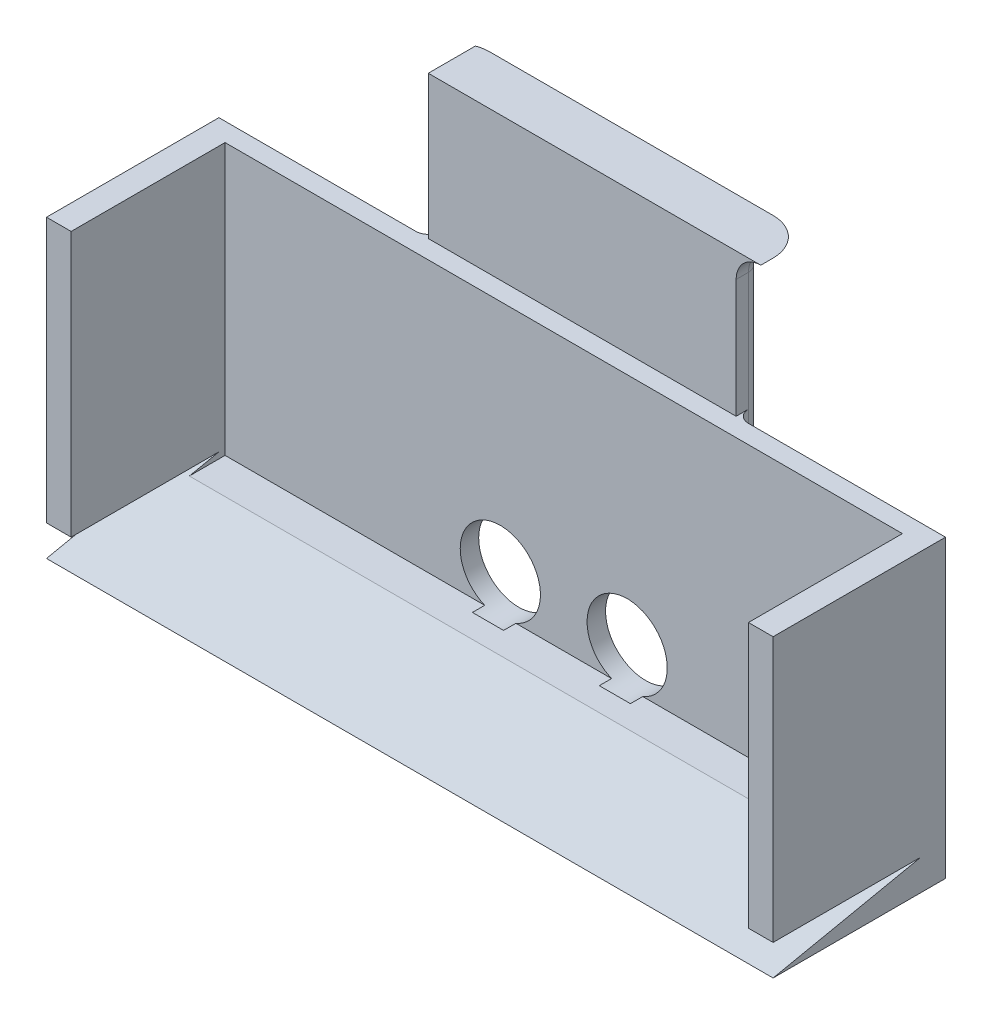
ISO-10303-21;
HEADER;
FILE_DESCRIPTION(('STEP AP214'),'2;1');
FILE_NAME('part.step','',(''),(''),'','','');
FILE_SCHEMA(('AUTOMOTIVE_DESIGN { 1 0 10303 214 1 1 1 1 }'));
ENDSEC;
DATA;
#1=APPLICATION_CONTEXT('core data for automotive mechanical design processes');
#2=APPLICATION_PROTOCOL_DEFINITION('international standard','automotive_design',2000,#1);
#3=PRODUCT_CONTEXT('',#1,'mechanical');
#4=PRODUCT('Part','Part','',(#3));
#5=PRODUCT_RELATED_PRODUCT_CATEGORY('part','',(#4));
#6=PRODUCT_DEFINITION_FORMATION('','',#4);
#7=PRODUCT_DEFINITION_CONTEXT('part definition',#1,'design');
#8=PRODUCT_DEFINITION('design','',#6,#7);
#9=PRODUCT_DEFINITION_SHAPE('','',#8);
#10=(LENGTH_UNIT() NAMED_UNIT(*) SI_UNIT(.MILLI.,.METRE.));
#11=(NAMED_UNIT(*) PLANE_ANGLE_UNIT() SI_UNIT($,.RADIAN.));
#12=(NAMED_UNIT(*) SI_UNIT($,.STERADIAN.) SOLID_ANGLE_UNIT());
#13=UNCERTAINTY_MEASURE_WITH_UNIT(LENGTH_MEASURE(1.E-05),#10,'distance_accuracy_value','');
#14=(GEOMETRIC_REPRESENTATION_CONTEXT(3) GLOBAL_UNCERTAINTY_ASSIGNED_CONTEXT((#13)) GLOBAL_UNIT_ASSIGNED_CONTEXT((#10,
#11,#12)) REPRESENTATION_CONTEXT('',''));
#15=CARTESIAN_POINT('',(0.,0.,0.));
#16=DIRECTION('',(0.,0.,1.));
#17=DIRECTION('',(1.,0.,0.));
#18=AXIS2_PLACEMENT_3D('',#15,#16,#17);
#19=CARTESIAN_POINT('',(31.75,39.6875,-24.765));
#20=DIRECTION('',(1.,0.,0.));
#21=DIRECTION('',(0.,0.,-1.));
#22=AXIS2_PLACEMENT_3D('',#19,#20,#21);
#23=PLANE('',#22);
#24=DIRECTION('',(0.,1.,0.));
#25=VECTOR('',#24,1.);
#26=CARTESIAN_POINT('',(31.75,90.4875,-22.225));
#27=LINE('',#26,#25);
#28=CARTESIAN_POINT('',(31.75,60.96,-22.225));
#29=VERTEX_POINT('',#28);
#30=CARTESIAN_POINT('',(31.75,85.4075,-22.225));
#31=VERTEX_POINT('',#30);
#32=EDGE_CURVE('E233',#29,#31,#27,.T.);
#33=ORIENTED_EDGE('',*,*,#32,.T.);
#34=DIRECTION('',(0.,0.,-1.));
#35=VECTOR('',#34,1.);
#36=CARTESIAN_POINT('',(31.75,85.4075,-24.765));
#37=LINE('',#36,#35);
#38=CARTESIAN_POINT('',(31.75,85.4075,-19.685));
#39=VERTEX_POINT('',#38);
#40=EDGE_CURVE('E54',#31,#39,#37,.F.);
#41=ORIENTED_EDGE('',*,*,#40,.T.);
#42=DIRECTION('',(0.,1.,0.));
#43=VECTOR('',#42,1.);
#44=CARTESIAN_POINT('',(31.75,39.6875,-19.685));
#45=LINE('',#44,#43);
#46=CARTESIAN_POINT('',(31.75,60.96,-19.685));
#47=VERTEX_POINT('',#46);
#48=EDGE_CURVE('E435',#47,#39,#45,.T.);
#49=ORIENTED_EDGE('',*,*,#48,.F.);
#50=DIRECTION('',(0.,0.,-1.));
#51=VECTOR('',#50,1.);
#52=CARTESIAN_POINT('',(31.75,60.96,-24.765));
#53=LINE('',#52,#51);
#54=EDGE_CURVE('E360',#47,#29,#53,.T.);
#55=ORIENTED_EDGE('',*,*,#54,.T.);
#56=EDGE_LOOP('',(#33,#41,#49,#55));
#57=FACE_BOUND('',#56,.T.);
#58=ADVANCED_FACE('F36',(#57),#23,.T.);
#59=CARTESIAN_POINT('',(0.,5.08,0.));
#60=DIRECTION('',(0.,-1.,0.));
#61=DIRECTION('',(0.,0.,-1.));
#62=AXIS2_PLACEMENT_3D('',#59,#60,#61);
#63=PLANE('',#62);
#64=DIRECTION('',(0.,0.,-1.));
#65=VECTOR('',#64,1.);
#66=CARTESIAN_POINT('',(-16.2939452376118,5.08,-13.335));
#67=LINE('',#66,#65);
#68=CARTESIAN_POINT('',(-16.2939452376118,5.08,-15.875));
#69=VERTEX_POINT('',#68);
#70=CARTESIAN_POINT('',(-16.2939452376118,5.08,-13.335));
#71=VERTEX_POINT('',#70);
#72=EDGE_CURVE('E428',#69,#71,#67,.F.);
#73=ORIENTED_EDGE('',*,*,#72,.F.);
#74=DIRECTION('',(1.,0.,0.));
#75=VECTOR('',#74,1.);
#76=CARTESIAN_POINT('',(-69.85,5.08,-15.875));
#77=LINE('',#76,#75);
#78=CARTESIAN_POINT('',(-69.85,5.08,-15.875));
#79=VERTEX_POINT('',#78);
#80=EDGE_CURVE('E522',#79,#69,#77,.T.);
#81=ORIENTED_EDGE('',*,*,#80,.F.);
#82=DIRECTION('',(0.,0.,-1.));
#83=VECTOR('',#82,1.);
#84=CARTESIAN_POINT('',(-69.85,5.08,15.875));
#85=LINE('',#84,#83);
#86=CARTESIAN_POINT('',(-69.85,5.08,-8.50899999999995));
#87=VERTEX_POINT('',#86);
#88=EDGE_CURVE('E519',#87,#79,#85,.T.);
#89=ORIENTED_EDGE('',*,*,#88,.F.);
#90=DIRECTION('',(1.,0.,0.));
#91=VECTOR('',#90,1.);
#92=CARTESIAN_POINT('',(0.,5.08,-8.50899999999999));
#93=LINE('',#92,#91);
#94=CARTESIAN_POINT('',(69.85,5.08,-8.50899999999999));
#95=VERTEX_POINT('',#94);
#96=EDGE_CURVE('E456',#87,#95,#93,.T.);
#97=ORIENTED_EDGE('',*,*,#96,.T.);
#98=DIRECTION('',(0.,0.,-1.));
#99=VECTOR('',#98,1.);
#100=CARTESIAN_POINT('',(69.85,5.08,15.875));
#101=LINE('',#100,#99);
#102=CARTESIAN_POINT('',(69.85,5.08,-15.875));
#103=VERTEX_POINT('',#102);
#104=EDGE_CURVE('E525',#95,#103,#101,.T.);
#105=ORIENTED_EDGE('',*,*,#104,.T.);
#106=CARTESIAN_POINT('',(16.2939452376118,5.08,-15.875));
#107=VERTEX_POINT('',#106);
#108=EDGE_CURVE('E521',#107,#103,#77,.T.);
#109=ORIENTED_EDGE('',*,*,#108,.F.);
#110=DIRECTION('',(0.,0.,-1.));
#111=VECTOR('',#110,1.);
#112=CARTESIAN_POINT('',(16.2939452376118,5.08,-13.335));
#113=LINE('',#112,#111);
#114=CARTESIAN_POINT('',(16.2939452376118,5.08,-13.335));
#115=VERTEX_POINT('',#114);
#116=EDGE_CURVE('E417',#115,#107,#113,.T.);
#117=ORIENTED_EDGE('',*,*,#116,.F.);
#118=DIRECTION('',(-1.,0.,0.));
#119=VECTOR('',#118,1.);
#120=CARTESIAN_POINT('',(0.,5.08,-13.335));
#121=LINE('',#120,#119);
#122=CARTESIAN_POINT('',(9.8680547623882,5.08,-13.335));
#123=VERTEX_POINT('',#122);
#124=EDGE_CURVE('E539',#115,#123,#121,.T.);
#125=ORIENTED_EDGE('',*,*,#124,.T.);
#126=DIRECTION('',(0.,0.,-1.));
#127=VECTOR('',#126,1.);
#128=CARTESIAN_POINT('',(9.8680547623882,5.08,-13.335));
#129=LINE('',#128,#127);
#130=CARTESIAN_POINT('',(9.8680547623882,5.08,-15.875));
#131=VERTEX_POINT('',#130);
#132=EDGE_CURVE('E421',#131,#123,#129,.F.);
#133=ORIENTED_EDGE('',*,*,#132,.F.);
#134=CARTESIAN_POINT('',(-9.86805476238824,5.08,-15.875));
#135=VERTEX_POINT('',#134);
#136=EDGE_CURVE('E526',#135,#131,#77,.T.);
#137=ORIENTED_EDGE('',*,*,#136,.F.);
#138=DIRECTION('',(0.,0.,-1.));
#139=VECTOR('',#138,1.);
#140=CARTESIAN_POINT('',(-9.86805476238824,5.08,-13.335));
#141=LINE('',#140,#139);
#142=CARTESIAN_POINT('',(-9.86805476238824,5.08,-13.335));
#143=VERTEX_POINT('',#142);
#144=EDGE_CURVE('E426',#143,#135,#141,.T.);
#145=ORIENTED_EDGE('',*,*,#144,.F.);
#146=DIRECTION('',(-1.,0.,0.));
#147=VECTOR('',#146,1.);
#148=CARTESIAN_POINT('',(0.,5.08,-13.335));
#149=LINE('',#148,#147);
#150=EDGE_CURVE('E542',#143,#71,#149,.T.);
#151=ORIENTED_EDGE('',*,*,#150,.T.);
#152=EDGE_LOOP('',(#73,#81,#89,#97,#105,#109,#117,#125,#133,#137,#145,#151));
#153=FACE_BOUND('',#152,.T.);
#154=ADVANCED_FACE('F284',(#153),#63,.F.);
#155=CARTESIAN_POINT('',(0.,0.,-19.685));
#156=DIRECTION('',(0.,0.,-1.));
#157=DIRECTION('',(-1.,0.,0.));
#158=AXIS2_PLACEMENT_3D('',#155,#156,#157);
#159=PLANE('',#158);
#160=CARTESIAN_POINT('',(-13.081,12.7,-19.685));
#161=DIRECTION('',(0.,0.,-1.));
#162=DIRECTION('',(-1.,0.,0.));
#163=AXIS2_PLACEMENT_3D('',#160,#161,#162);
#164=CIRCLE('',#163,8.2696685);
#165=CARTESIAN_POINT('',(-21.3506685,12.7,-19.685));
#166=VERTEX_POINT('',#165);
#167=EDGE_CURVE('E430',#166,#166,#164,.F.);
#168=ORIENTED_EDGE('',*,*,#167,.T.);
#169=EDGE_LOOP('',(#168));
#170=FACE_BOUND('',#169,.T.);
#171=CARTESIAN_POINT('',(13.081,12.7,-19.685));
#172=DIRECTION('',(0.,0.,-1.));
#173=DIRECTION('',(-1.,0.,0.));
#174=AXIS2_PLACEMENT_3D('',#171,#172,#173);
#175=CIRCLE('',#174,8.26966850000001);
#176=CARTESIAN_POINT('',(4.81133149999999,12.7,-19.685));
#177=VERTEX_POINT('',#176);
#178=EDGE_CURVE('E423',#177,#177,#175,.F.);
#179=ORIENTED_EDGE('',*,*,#178,.T.);
#180=EDGE_LOOP('',(#179));
#181=FACE_BOUND('',#180,.T.);
#182=DIRECTION('',(1.,0.,0.));
#183=VECTOR('',#182,1.);
#184=CARTESIAN_POINT('',(74.93,60.96,-19.685));
#185=LINE('',#184,#183);
#186=CARTESIAN_POINT('',(-74.93,60.96,-19.685));
#187=VERTEX_POINT('',#186);
#188=CARTESIAN_POINT('',(-34.29,60.96,-19.685));
#189=VERTEX_POINT('',#188);
#190=EDGE_CURVE('E475',#187,#189,#185,.T.);
#191=ORIENTED_EDGE('',*,*,#190,.T.);
#192=DIRECTION('',(0.,-1.,0.));
#193=VECTOR('',#192,1.);
#194=CARTESIAN_POINT('',(-34.29,39.6875,-19.685));
#195=LINE('',#194,#193);
#196=CARTESIAN_POINT('',(-34.29,37.1475,-19.685));
#197=VERTEX_POINT('',#196);
#198=EDGE_CURVE('E549',#189,#197,#195,.T.);
#199=ORIENTED_EDGE('',*,*,#198,.T.);
#200=DIRECTION('',(-1.,0.,0.));
#201=VECTOR('',#200,1.);
#202=CARTESIAN_POINT('',(0.,37.1475,-19.685));
#203=LINE('',#202,#201);
#204=CARTESIAN_POINT('',(34.29,37.1475,-19.685));
#205=VERTEX_POINT('',#204);
#206=EDGE_CURVE('E547',#197,#205,#203,.F.);
#207=ORIENTED_EDGE('',*,*,#206,.T.);
#208=DIRECTION('',(0.,1.,0.));
#209=VECTOR('',#208,1.);
#210=CARTESIAN_POINT('',(34.29,60.96,-19.685));
#211=LINE('',#210,#209);
#212=CARTESIAN_POINT('',(34.29,60.96,-19.685));
#213=VERTEX_POINT('',#212);
#214=EDGE_CURVE('E545',#205,#213,#211,.T.);
#215=ORIENTED_EDGE('',*,*,#214,.T.);
#216=CARTESIAN_POINT('',(74.93,60.96,-19.685));
#217=VERTEX_POINT('',#216);
#218=EDGE_CURVE('E474',#213,#217,#185,.T.);
#219=ORIENTED_EDGE('',*,*,#218,.T.);
#220=DIRECTION('',(0.,-1.,0.));
#221=VECTOR('',#220,1.);
#222=CARTESIAN_POINT('',(74.93,60.96,-19.685));
#223=LINE('',#222,#221);
#224=CARTESIAN_POINT('',(74.93,0.,-19.685));
#225=VERTEX_POINT('',#224);
#226=EDGE_CURVE('E465',#217,#225,#223,.T.);
#227=ORIENTED_EDGE('',*,*,#226,.T.);
#228=DIRECTION('',(-1.,0.,0.));
#229=VECTOR('',#228,1.);
#230=CARTESIAN_POINT('',(74.93,0.,-19.685));
#231=LINE('',#230,#229);
#232=CARTESIAN_POINT('',(-74.93,0.,-19.685));
#233=VERTEX_POINT('',#232);
#234=EDGE_CURVE('E468',#225,#233,#231,.T.);
#235=ORIENTED_EDGE('',*,*,#234,.T.);
#236=DIRECTION('',(0.,1.,0.));
#237=VECTOR('',#236,1.);
#238=CARTESIAN_POINT('',(-74.93,60.96,-19.685));
#239=LINE('',#238,#237);
#240=EDGE_CURVE('E471',#233,#187,#239,.T.);
#241=ORIENTED_EDGE('',*,*,#240,.T.);
#242=EDGE_LOOP('',(#191,#199,#207,#215,#219,#227,#235,#241));
#243=FACE_BOUND('',#242,.T.);
#244=ADVANCED_FACE('F280',(#170,#181,#243),#159,.T.);
#245=CARTESIAN_POINT('',(-69.85,5.08,15.875));
#246=DIRECTION('',(0.,0.,-1.));
#247=DIRECTION('',(-1.,0.,0.));
#248=AXIS2_PLACEMENT_3D('',#245,#246,#247);
#249=PLANE('',#248);
#250=DIRECTION('',(1.,0.,0.));
#251=VECTOR('',#250,1.);
#252=CARTESIAN_POINT('',(-74.93,6.35,15.875));
#253=LINE('',#252,#251);
#254=CARTESIAN_POINT('',(69.85,6.35,15.875));
#255=VERTEX_POINT('',#254);
#256=CARTESIAN_POINT('',(74.93,6.35,15.875));
#257=VERTEX_POINT('',#256);
#258=EDGE_CURVE('E452',#255,#257,#253,.T.);
#259=ORIENTED_EDGE('',*,*,#258,.T.);
#260=DIRECTION('',(0.,-1.,0.));
#261=VECTOR('',#260,1.);
#262=CARTESIAN_POINT('',(74.93,5.08,15.875));
#263=LINE('',#262,#261);
#264=CARTESIAN_POINT('',(74.93,60.96,15.875));
#265=VERTEX_POINT('',#264);
#266=EDGE_CURVE('E505',#265,#257,#263,.T.);
#267=ORIENTED_EDGE('',*,*,#266,.F.);
#268=DIRECTION('',(-1.,0.,0.));
#269=VECTOR('',#268,1.);
#270=CARTESIAN_POINT('',(74.93,60.96,15.875));
#271=LINE('',#270,#269);
#272=CARTESIAN_POINT('',(69.85,60.96,15.875));
#273=VERTEX_POINT('',#272);
#274=EDGE_CURVE('E508',#265,#273,#271,.T.);
#275=ORIENTED_EDGE('',*,*,#274,.T.);
#276=DIRECTION('',(0.,-1.,0.));
#277=VECTOR('',#276,1.);
#278=CARTESIAN_POINT('',(69.85,0.,15.875));
#279=LINE('',#278,#277);
#280=EDGE_CURVE('E503',#273,#255,#279,.T.);
#281=ORIENTED_EDGE('',*,*,#280,.T.);
#282=EDGE_LOOP('',(#259,#267,#275,#281));
#283=FACE_BOUND('',#282,.T.);
#284=ADVANCED_FACE('F283',(#283),#249,.F.);
#285=CARTESIAN_POINT('',(-74.93,6.35,15.875));
#286=VERTEX_POINT('',#285);
#287=CARTESIAN_POINT('',(-69.85,6.35,15.875));
#288=VERTEX_POINT('',#287);
#289=EDGE_CURVE('E453',#286,#288,#253,.T.);
#290=ORIENTED_EDGE('',*,*,#289,.T.);
#291=DIRECTION('',(0.,-1.,0.));
#292=VECTOR('',#291,1.);
#293=CARTESIAN_POINT('',(-69.85,5.08,15.875));
#294=LINE('',#293,#292);
#295=CARTESIAN_POINT('',(-69.85,60.96,15.875));
#296=VERTEX_POINT('',#295);
#297=EDGE_CURVE('E478',#296,#288,#294,.T.);
#298=ORIENTED_EDGE('',*,*,#297,.F.);
#299=DIRECTION('',(1.,0.,0.));
#300=VECTOR('',#299,1.);
#301=CARTESIAN_POINT('',(-74.93,60.96,15.875));
#302=LINE('',#301,#300);
#303=CARTESIAN_POINT('',(-74.93,60.96,15.875));
#304=VERTEX_POINT('',#303);
#305=EDGE_CURVE('E491',#304,#296,#302,.T.);
#306=ORIENTED_EDGE('',*,*,#305,.F.);
#307=DIRECTION('',(0.,-1.,0.));
#308=VECTOR('',#307,1.);
#309=CARTESIAN_POINT('',(-74.93,0.,15.875));
#310=LINE('',#309,#308);
#311=EDGE_CURVE('E484',#304,#286,#310,.T.);
#312=ORIENTED_EDGE('',*,*,#311,.T.);
#313=EDGE_LOOP('',(#290,#298,#306,#312));
#314=FACE_BOUND('',#313,.T.);
#315=ADVANCED_FACE('F307',(#314),#249,.F.);
#316=CARTESIAN_POINT('',(69.85,0.,0.));
#317=DIRECTION('',(-1.,0.,0.));
#318=DIRECTION('',(0.,0.,1.));
#319=AXIS2_PLACEMENT_3D('',#316,#317,#318);
#320=PLANE('',#319);
#321=DIRECTION('',(0.,-0.203954254112001,0.978980419737605));
#322=VECTOR('',#321,1.);
#323=CARTESIAN_POINT('',(69.85,3.16971713810316,0.660357737104825));
#324=LINE('',#323,#322);
#325=CARTESIAN_POINT('',(69.85,6.35,-14.605));
#326=VERTEX_POINT('',#325);
#327=EDGE_CURVE('E459',#326,#95,#324,.T.);
#328=ORIENTED_EDGE('',*,*,#327,.F.);
#329=DIRECTION('',(0.,0.,1.));
#330=VECTOR('',#329,1.);
#331=CARTESIAN_POINT('',(69.85,6.35,0.));
#332=LINE('',#331,#330);
#333=EDGE_CURVE('E461',#326,#255,#332,.T.);
#334=ORIENTED_EDGE('',*,*,#333,.T.);
#335=ORIENTED_EDGE('',*,*,#280,.F.);
#336=DIRECTION('',(0.,0.,1.));
#337=VECTOR('',#336,1.);
#338=CARTESIAN_POINT('',(69.85,60.96,15.875));
#339=LINE('',#338,#337);
#340=CARTESIAN_POINT('',(69.85,60.96,-15.875));
#341=VERTEX_POINT('',#340);
#342=EDGE_CURVE('E511',#341,#273,#339,.T.);
#343=ORIENTED_EDGE('',*,*,#342,.F.);
#344=DIRECTION('',(0.,1.,0.));
#345=VECTOR('',#344,1.);
#346=CARTESIAN_POINT('',(69.85,60.96,-15.875));
#347=LINE('',#346,#345);
#348=EDGE_CURVE('E499',#103,#341,#347,.T.);
#349=ORIENTED_EDGE('',*,*,#348,.F.);
#350=ORIENTED_EDGE('',*,*,#104,.F.);
#351=EDGE_LOOP('',(#328,#334,#335,#343,#349,#350));
#352=FACE_BOUND('',#351,.T.);
#353=ADVANCED_FACE('F303',(#352),#320,.T.);
#354=CARTESIAN_POINT('',(74.93,0.,0.));
#355=DIRECTION('',(-1.,0.,0.));
#356=DIRECTION('',(0.,0.,1.));
#357=AXIS2_PLACEMENT_3D('',#354,#355,#356);
#358=PLANE('',#357);
#359=DIRECTION('',(0.,0.,-1.));
#360=VECTOR('',#359,1.);
#361=CARTESIAN_POINT('',(74.93,6.35,15.875));
#362=LINE('',#361,#360);
#363=CARTESIAN_POINT('',(74.93,6.35,-14.605));
#364=VERTEX_POINT('',#363);
#365=EDGE_CURVE('E437',#257,#364,#362,.T.);
#366=ORIENTED_EDGE('',*,*,#365,.T.);
#367=DIRECTION('',(0.,0.203954254112001,-0.978980419737605));
#368=VECTOR('',#367,1.);
#369=CARTESIAN_POINT('',(74.93,0.,15.875));
#370=LINE('',#369,#368);
#371=CARTESIAN_POINT('',(74.93,0.,15.875));
#372=VERTEX_POINT('',#371);
#373=EDGE_CURVE('E441',#372,#364,#370,.T.);
#374=ORIENTED_EDGE('',*,*,#373,.F.);
#375=DIRECTION('',(0.,0.,-1.));
#376=VECTOR('',#375,1.);
#377=CARTESIAN_POINT('',(74.93,0.,-15.875));
#378=LINE('',#377,#376);
#379=EDGE_CURVE('E500',#372,#225,#378,.T.);
#380=ORIENTED_EDGE('',*,*,#379,.T.);
#381=ORIENTED_EDGE('',*,*,#226,.F.);
#382=DIRECTION('',(0.,0.,1.));
#383=VECTOR('',#382,1.);
#384=CARTESIAN_POINT('',(74.93,60.96,15.875));
#385=LINE('',#384,#383);
#386=EDGE_CURVE('E502',#217,#265,#385,.T.);
#387=ORIENTED_EDGE('',*,*,#386,.T.);
#388=ORIENTED_EDGE('',*,*,#266,.T.);
#389=EDGE_LOOP('',(#366,#374,#380,#381,#387,#388));
#390=FACE_BOUND('',#389,.T.);
#391=ADVANCED_FACE('F295',(#390),#358,.F.);
#392=CARTESIAN_POINT('',(-74.93,0.,0.));
#393=DIRECTION('',(1.,0.,0.));
#394=DIRECTION('',(0.,0.,1.));
#395=AXIS2_PLACEMENT_3D('',#392,#393,#394);
#396=PLANE('',#395);
#397=DIRECTION('',(0.,0.,-1.));
#398=VECTOR('',#397,1.);
#399=CARTESIAN_POINT('',(-74.93,6.35,15.875));
#400=LINE('',#399,#398);
#401=CARTESIAN_POINT('',(-74.93,6.35,-14.605));
#402=VERTEX_POINT('',#401);
#403=EDGE_CURVE('E438',#286,#402,#400,.T.);
#404=ORIENTED_EDGE('',*,*,#403,.F.);
#405=ORIENTED_EDGE('',*,*,#311,.F.);
#406=DIRECTION('',(0.,0.,1.));
#407=VECTOR('',#406,1.);
#408=CARTESIAN_POINT('',(-74.93,60.96,15.875));
#409=LINE('',#408,#407);
#410=EDGE_CURVE('E488',#187,#304,#409,.T.);
#411=ORIENTED_EDGE('',*,*,#410,.F.);
#412=ORIENTED_EDGE('',*,*,#240,.F.);
#413=DIRECTION('',(0.,0.,-1.));
#414=VECTOR('',#413,1.);
#415=CARTESIAN_POINT('',(-74.93,0.,-15.875));
#416=LINE('',#415,#414);
#417=CARTESIAN_POINT('',(-74.93,0.,15.875));
#418=VERTEX_POINT('',#417);
#419=EDGE_CURVE('E482',#418,#233,#416,.T.);
#420=ORIENTED_EDGE('',*,*,#419,.F.);
#421=DIRECTION('',(0.,0.203954254112001,-0.978980419737605));
#422=VECTOR('',#421,1.);
#423=CARTESIAN_POINT('',(-74.93,0.,15.875));
#424=LINE('',#423,#422);
#425=EDGE_CURVE('E440',#418,#402,#424,.T.);
#426=ORIENTED_EDGE('',*,*,#425,.T.);
#427=EDGE_LOOP('',(#404,#405,#411,#412,#420,#426));
#428=FACE_BOUND('',#427,.T.);
#429=ADVANCED_FACE('F291',(#428),#396,.F.);
#430=CARTESIAN_POINT('',(-69.85,0.,0.));
#431=DIRECTION('',(1.,0.,0.));
#432=DIRECTION('',(0.,0.,1.));
#433=AXIS2_PLACEMENT_3D('',#430,#431,#432);
#434=PLANE('',#433);
#435=ORIENTED_EDGE('',*,*,#297,.T.);
#436=DIRECTION('',(0.,0.,-1.));
#437=VECTOR('',#436,1.);
#438=CARTESIAN_POINT('',(-69.85,6.35,0.));
#439=LINE('',#438,#437);
#440=CARTESIAN_POINT('',(-69.85,6.35,-14.605));
#441=VERTEX_POINT('',#440);
#442=EDGE_CURVE('E532',#288,#441,#439,.T.);
#443=ORIENTED_EDGE('',*,*,#442,.T.);
#444=DIRECTION('',(0.,0.203954254112001,-0.978980419737605));
#445=VECTOR('',#444,1.);
#446=CARTESIAN_POINT('',(-69.85,3.16971713810316,0.660357737104825));
#447=LINE('',#446,#445);
#448=EDGE_CURVE('E529',#87,#441,#447,.T.);
#449=ORIENTED_EDGE('',*,*,#448,.F.);
#450=ORIENTED_EDGE('',*,*,#88,.T.);
#451=DIRECTION('',(0.,1.,0.));
#452=VECTOR('',#451,1.);
#453=CARTESIAN_POINT('',(-69.85,5.08,-15.875));
#454=LINE('',#453,#452);
#455=CARTESIAN_POINT('',(-69.85,60.96,-15.875));
#456=VERTEX_POINT('',#455);
#457=EDGE_CURVE('E485',#79,#456,#454,.T.);
#458=ORIENTED_EDGE('',*,*,#457,.T.);
#459=DIRECTION('',(0.,0.,1.));
#460=VECTOR('',#459,1.);
#461=CARTESIAN_POINT('',(-69.85,60.96,15.875));
#462=LINE('',#461,#460);
#463=EDGE_CURVE('E494',#456,#296,#462,.T.);
#464=ORIENTED_EDGE('',*,*,#463,.T.);
#465=EDGE_LOOP('',(#435,#443,#449,#450,#458,#464));
#466=FACE_BOUND('',#465,.T.);
#467=ADVANCED_FACE('F294',(#466),#434,.T.);
#468=CARTESIAN_POINT('',(0.,0.,0.));
#469=DIRECTION('',(0.,-1.,0.));
#470=DIRECTION('',(0.,0.,-1.));
#471=AXIS2_PLACEMENT_3D('',#468,#469,#470);
#472=PLANE('',#471);
#473=DIRECTION('',(1.,0.,0.));
#474=VECTOR('',#473,1.);
#475=CARTESIAN_POINT('',(-69.85,0.,15.875));
#476=LINE('',#475,#474);
#477=EDGE_CURVE('E518',#418,#372,#476,.T.);
#478=ORIENTED_EDGE('',*,*,#477,.F.);
#479=ORIENTED_EDGE('',*,*,#419,.T.);
#480=ORIENTED_EDGE('',*,*,#234,.F.);
#481=ORIENTED_EDGE('',*,*,#379,.F.);
#482=EDGE_LOOP('',(#478,#479,#480,#481));
#483=FACE_BOUND('',#482,.T.);
#484=ADVANCED_FACE('F299',(#483),#472,.T.);
#485=CARTESIAN_POINT('',(74.93,60.96,15.875));
#486=DIRECTION('',(0.,-1.,0.));
#487=DIRECTION('',(0.,0.,-1.));
#488=AXIS2_PLACEMENT_3D('',#485,#486,#487);
#489=PLANE('',#488);
#490=ORIENTED_EDGE('',*,*,#342,.T.);
#491=ORIENTED_EDGE('',*,*,#274,.F.);
#492=ORIENTED_EDGE('',*,*,#386,.F.);
#493=ORIENTED_EDGE('',*,*,#218,.F.);
#494=CARTESIAN_POINT('',(34.29,60.96,-22.225));
#495=DIRECTION('',(0.,-1.,0.));
#496=DIRECTION('',(0.,0.,-1.));
#497=AXIS2_PLACEMENT_3D('',#494,#495,#496);
#498=CIRCLE('',#497,2.54);
#499=EDGE_CURVE('E387',#213,#29,#498,.T.);
#500=ORIENTED_EDGE('',*,*,#499,.T.);
#501=ORIENTED_EDGE('',*,*,#54,.F.);
#502=CARTESIAN_POINT('',(-31.75,60.96,-19.685));
#503=VERTEX_POINT('',#502);
#504=EDGE_CURVE('E479',#503,#47,#185,.T.);
#505=ORIENTED_EDGE('',*,*,#504,.F.);
#506=DIRECTION('',(0.,0.,1.));
#507=VECTOR('',#506,1.);
#508=CARTESIAN_POINT('',(-31.75,60.96,-24.765));
#509=LINE('',#508,#507);
#510=CARTESIAN_POINT('',(-31.75,60.96,-22.225));
#511=VERTEX_POINT('',#510);
#512=EDGE_CURVE('E552',#511,#503,#509,.T.);
#513=ORIENTED_EDGE('',*,*,#512,.F.);
#514=CARTESIAN_POINT('',(-34.29,60.96,-22.225));
#515=DIRECTION('',(0.,-1.,0.));
#516=DIRECTION('',(0.,0.,-1.));
#517=AXIS2_PLACEMENT_3D('',#514,#515,#516);
#518=CIRCLE('',#517,2.54);
#519=EDGE_CURVE('E557',#511,#189,#518,.T.);
#520=ORIENTED_EDGE('',*,*,#519,.T.);
#521=ORIENTED_EDGE('',*,*,#190,.F.);
#522=ORIENTED_EDGE('',*,*,#410,.T.);
#523=ORIENTED_EDGE('',*,*,#305,.T.);
#524=ORIENTED_EDGE('',*,*,#463,.F.);
#525=DIRECTION('',(1.,0.,0.));
#526=VECTOR('',#525,1.);
#527=CARTESIAN_POINT('',(74.93,60.96,-15.875));
#528=LINE('',#527,#526);
#529=EDGE_CURVE('E464',#456,#341,#528,.T.);
#530=ORIENTED_EDGE('',*,*,#529,.T.);
#531=EDGE_LOOP('',(#490,#491,#492,#493,#500,#501,#505,#513,#520,#521,#522,#523,#524,#530));
#532=FACE_BOUND('',#531,.T.);
#533=ADVANCED_FACE('F289',(#532),#489,.F.);
#534=CARTESIAN_POINT('',(0.,0.,-15.875));
#535=DIRECTION('',(0.,0.,-1.));
#536=DIRECTION('',(-1.,0.,0.));
#537=AXIS2_PLACEMENT_3D('',#534,#535,#536);
#538=PLANE('',#537);
#539=CARTESIAN_POINT('',(-13.081,12.7,-15.875));
#540=DIRECTION('',(0.,0.,-1.));
#541=DIRECTION('',(-1.,0.,0.));
#542=AXIS2_PLACEMENT_3D('',#539,#540,#541);
#543=CIRCLE('',#542,8.2696685);
#544=EDGE_CURVE('E537',#135,#69,#543,.F.);
#545=ORIENTED_EDGE('',*,*,#544,.F.);
#546=ORIENTED_EDGE('',*,*,#136,.T.);
#547=CARTESIAN_POINT('',(13.081,12.7,-15.875));
#548=DIRECTION('',(0.,0.,-1.));
#549=DIRECTION('',(-1.,0.,0.));
#550=AXIS2_PLACEMENT_3D('',#547,#548,#549);
#551=CIRCLE('',#550,8.26966850000001);
#552=EDGE_CURVE('E535',#107,#131,#551,.F.);
#553=ORIENTED_EDGE('',*,*,#552,.F.);
#554=ORIENTED_EDGE('',*,*,#108,.T.);
#555=ORIENTED_EDGE('',*,*,#348,.T.);
#556=ORIENTED_EDGE('',*,*,#529,.F.);
#557=ORIENTED_EDGE('',*,*,#457,.F.);
#558=ORIENTED_EDGE('',*,*,#80,.T.);
#559=EDGE_LOOP('',(#545,#546,#553,#554,#555,#556,#557,#558));
#560=FACE_BOUND('',#559,.T.);
#561=ADVANCED_FACE('F286',(#560),#538,.F.);
#562=CARTESIAN_POINT('',(-74.93,6.35,15.875));
#563=DIRECTION('',(0.,-1.,0.));
#564=DIRECTION('',(0.,0.,-1.));
#565=AXIS2_PLACEMENT_3D('',#562,#563,#564);
#566=PLANE('',#565);
#567=DIRECTION('',(1.,0.,0.));
#568=VECTOR('',#567,1.);
#569=CARTESIAN_POINT('',(-74.93,6.35,-14.605));
#570=LINE('',#569,#568);
#571=EDGE_CURVE('E444',#326,#364,#570,.T.);
#572=ORIENTED_EDGE('',*,*,#571,.T.);
#573=ORIENTED_EDGE('',*,*,#365,.F.);
#574=ORIENTED_EDGE('',*,*,#258,.F.);
#575=ORIENTED_EDGE('',*,*,#333,.F.);
#576=EDGE_LOOP('',(#572,#573,#574,#575));
#577=FACE_BOUND('',#576,.T.);
#578=ADVANCED_FACE('F278',(#577),#566,.T.);
#579=ORIENTED_EDGE('',*,*,#289,.F.);
#580=ORIENTED_EDGE('',*,*,#403,.T.);
#581=EDGE_CURVE('E449',#402,#441,#570,.T.);
#582=ORIENTED_EDGE('',*,*,#581,.T.);
#583=ORIENTED_EDGE('',*,*,#442,.F.);
#584=EDGE_LOOP('',(#579,#580,#582,#583));
#585=FACE_BOUND('',#584,.T.);
#586=ADVANCED_FACE('F274',(#585),#566,.T.);
#587=CARTESIAN_POINT('',(-74.93,0.,15.875));
#588=DIRECTION('',(0.,-0.978980419737605,-0.203954254112001));
#589=DIRECTION('',(0.,0.203954254112001,-0.978980419737605));
#590=AXIS2_PLACEMENT_3D('',#587,#588,#589);
#591=PLANE('',#590);
#592=ORIENTED_EDGE('',*,*,#327,.T.);
#593=ORIENTED_EDGE('',*,*,#96,.F.);
#594=ORIENTED_EDGE('',*,*,#448,.T.);
#595=ORIENTED_EDGE('',*,*,#581,.F.);
#596=ORIENTED_EDGE('',*,*,#425,.F.);
#597=ORIENTED_EDGE('',*,*,#477,.T.);
#598=ORIENTED_EDGE('',*,*,#373,.T.);
#599=ORIENTED_EDGE('',*,*,#571,.F.);
#600=EDGE_LOOP('',(#592,#593,#594,#595,#596,#597,#598,#599));
#601=FACE_BOUND('',#600,.T.);
#602=ADVANCED_FACE('F269',(#601),#591,.F.);
#603=CARTESIAN_POINT('',(-31.75,90.4875,-24.765));
#604=DIRECTION('',(-1.,0.,0.));
#605=DIRECTION('',(0.,-1.,0.));
#606=AXIS2_PLACEMENT_3D('',#603,#604,#605);
#607=PLANE('',#606);
#608=DIRECTION('',(0.,0.,1.));
#609=VECTOR('',#608,1.);
#610=CARTESIAN_POINT('',(-31.75,90.4875,-24.765));
#611=LINE('',#610,#609);
#612=CARTESIAN_POINT('',(-31.75,90.4875,-29.4092048968553));
#613=VERTEX_POINT('',#612);
#614=CARTESIAN_POINT('',(-31.75,90.4875,-19.685));
#615=VERTEX_POINT('',#614);
#616=EDGE_CURVE('E240',#613,#615,#611,.T.);
#617=ORIENTED_EDGE('',*,*,#616,.F.);
#618=CARTESIAN_POINT('',(-31.75,90.4875,-29.4092048968553));
#619=CARTESIAN_POINT('',(-31.75,90.4875221778939,-29.2470865976146));
#620=CARTESIAN_POINT('',(-31.75,90.4806036308379,-29.0850029122507));
#621=CARTESIAN_POINT('',(-31.75,90.45336914901,-28.7620609458733));
#622=CARTESIAN_POINT('',(-31.75,90.4330615242575,-28.6012019673393));
#623=CARTESIAN_POINT('',(-31.75,90.3796711556445,-28.2824938370112));
#624=CARTESIAN_POINT('',(-31.75,90.3466554817164,-28.1246333744674));
#625=CARTESIAN_POINT('',(-31.75,90.2684453351998,-27.8119441855667));
#626=CARTESIAN_POINT('',(-31.75,90.2232489413536,-27.6571159416157));
#627=CARTESIAN_POINT('',(-31.75,90.1190351586456,-27.3442961643697));
#628=CARTESIAN_POINT('',(-31.75,90.0594799309945,-27.1864841202599));
#629=CARTESIAN_POINT('',(-31.75,89.9286612622997,-26.8757392749875));
#630=CARTESIAN_POINT('',(-31.75,89.8573934354632,-26.7228083272706));
#631=CARTESIAN_POINT('',(-31.75,89.7040547015421,-26.4223408665901));
#632=CARTESIAN_POINT('',(-31.75,89.6219762919832,-26.2748081916933));
#633=CARTESIAN_POINT('',(-31.75,89.4480391692332,-25.9856092390857));
#634=CARTESIAN_POINT('',(-31.75,89.3561780462067,-25.8439444188317));
#635=CARTESIAN_POINT('',(-31.75,89.1017133236884,-25.47746213327));
#636=CARTESIAN_POINT('',(-31.75,88.9316305730229,-25.2578079632047));
#637=CARTESIAN_POINT('',(-31.75,88.5722421252194,-24.8348273046011));
#638=CARTESIAN_POINT('',(-31.75,88.3829244549179,-24.6315111287276));
#639=CARTESIAN_POINT('',(-31.75,87.9891266267437,-24.2395858023024));
#640=CARTESIAN_POINT('',(-31.75,87.784621365326,-24.0510021081464));
#641=CARTESIAN_POINT('',(-31.75,87.3646887024804,-23.6864169718433));
#642=CARTESIAN_POINT('',(-31.75,87.149257690536,-23.5104197359281));
#643=CARTESIAN_POINT('',(-31.75,86.807273091089,-23.242911670943));
#644=CARTESIAN_POINT('',(-31.75,86.6831830230457,-23.148203572342));
#645=CARTESIAN_POINT('',(-31.75,86.4334694972507,-22.9611514436517));
#646=CARTESIAN_POINT('',(-31.75,86.3078480921858,-22.8688046735507));
#647=CARTESIAN_POINT('',(-31.75,85.9289834716525,-22.5938215265443));
#648=CARTESIAN_POINT('',(-31.75,85.6740735810182,-22.4134971420418));
#649=CARTESIAN_POINT('',(-31.75,85.4152593412781,-22.2304866817042));
#650=CARTESIAN_POINT('',(-31.75,85.4113796696282,-22.2277433395458));
#651=CARTESIAN_POINT('',(-31.75,85.4075,-22.225));
#652=B_SPLINE_CURVE_WITH_KNOTS('',3,(#618,#619,#620,#621,#622,#623,#624,#625,#626,#627,#628,
#629,#630,#631,#632,#633,#634,#635,#636,#637,#638,#639,#640,#641,#642,#643,#644,#645,#646,#647,
#648,#649,#650,#651),.UNSPECIFIED.,.F.,.F.,(4,2,2,2,2,2,2,2,2,2,2,2,2,2,2,2,4),(0.,
0.486156207551298,0.972010962734568,1.45533589878573,1.93873711405424,2.44426028104783,
2.94997317473503,3.45603889756847,3.96222957227925,4.79420354341885,5.62669860380763,
6.46060170735768,7.2947822007554,7.76306860814136,8.23078440609089,9.1674752136328,
9.18173003737775),.UNSPECIFIED.);
#653=CARTESIAN_POINT('',(-31.75,85.4075,-22.225));
#654=VERTEX_POINT('',#653);
#655=EDGE_CURVE('E46',#613,#654,#652,.T.);
#656=ORIENTED_EDGE('',*,*,#655,.T.);
#657=DIRECTION('',(0.,-1.,0.));
#658=VECTOR('',#657,1.);
#659=CARTESIAN_POINT('',(-31.75,39.6875,-22.225));
#660=LINE('',#659,#658);
#661=EDGE_CURVE('E390',#654,#511,#660,.T.);
#662=ORIENTED_EDGE('',*,*,#661,.T.);
#663=ORIENTED_EDGE('',*,*,#512,.T.);
#664=DIRECTION('',(0.,-1.,0.));
#665=VECTOR('',#664,1.);
#666=CARTESIAN_POINT('',(-31.75,90.4875,-19.685));
#667=LINE('',#666,#665);
#668=EDGE_CURVE('E411',#615,#503,#667,.T.);
#669=ORIENTED_EDGE('',*,*,#668,.F.);
#670=EDGE_LOOP('',(#617,#656,#662,#663,#669));
#671=FACE_BOUND('',#670,.T.);
#672=ADVANCED_FACE('F263',(#671),#607,.T.);
#673=CARTESIAN_POINT('',(0.,0.,-24.765));
#674=DIRECTION('',(0.,0.,1.));
#675=DIRECTION('',(1.,0.,0.));
#676=AXIS2_PLACEMENT_3D('',#673,#674,#675);
#677=PLANE('',#676);
#678=DIRECTION('',(0.,-1.,0.));
#679=VECTOR('',#678,1.);
#680=CARTESIAN_POINT('',(-29.21,90.4875,-24.765));
#681=LINE('',#680,#679);
#682=CARTESIAN_POINT('',(-29.21,42.2275,-24.765));
#683=VERTEX_POINT('',#682);
#684=CARTESIAN_POINT('',(-29.21,85.4075,-24.765));
#685=VERTEX_POINT('',#684);
#686=EDGE_CURVE('E363',#683,#685,#681,.F.);
#687=ORIENTED_EDGE('',*,*,#686,.T.);
#688=DIRECTION('',(-1.,0.,0.));
#689=VECTOR('',#688,1.);
#690=CARTESIAN_POINT('',(0.,85.4075,-24.765));
#691=LINE('',#690,#689);
#692=CARTESIAN_POINT('',(29.21,85.4075,-24.765));
#693=VERTEX_POINT('',#692);
#694=EDGE_CURVE('E254',#685,#693,#691,.F.);
#695=ORIENTED_EDGE('',*,*,#694,.T.);
#696=DIRECTION('',(0.,1.,0.));
#697=VECTOR('',#696,1.);
#698=CARTESIAN_POINT('',(29.21,39.6875,-24.765));
#699=LINE('',#698,#697);
#700=CARTESIAN_POINT('',(29.21,42.2275,-24.765));
#701=VERTEX_POINT('',#700);
#702=EDGE_CURVE('E366',#693,#701,#699,.F.);
#703=ORIENTED_EDGE('',*,*,#702,.T.);
#704=DIRECTION('',(-1.,0.,0.));
#705=VECTOR('',#704,1.);
#706=CARTESIAN_POINT('',(0.,42.2275,-24.765));
#707=LINE('',#706,#705);
#708=EDGE_CURVE('E392',#701,#683,#707,.T.);
#709=ORIENTED_EDGE('',*,*,#708,.T.);
#710=EDGE_LOOP('',(#687,#695,#703,#709));
#711=FACE_BOUND('',#710,.T.);
#712=ADVANCED_FACE('F268',(#711),#677,.F.);
#713=CARTESIAN_POINT('',(0.,0.,-19.685));
#714=DIRECTION('',(0.,0.,1.));
#715=DIRECTION('',(1.,0.,0.));
#716=AXIS2_PLACEMENT_3D('',#713,#714,#715);
#717=PLANE('',#716);
#718=ORIENTED_EDGE('',*,*,#668,.T.);
#719=ORIENTED_EDGE('',*,*,#504,.T.);
#720=ORIENTED_EDGE('',*,*,#48,.T.);
#721=CARTESIAN_POINT('',(36.83,85.4075,-19.685));
#722=DIRECTION('',(0.,0.,1.));
#723=DIRECTION('',(1.,0.,0.));
#724=AXIS2_PLACEMENT_3D('',#721,#722,#723);
#725=CIRCLE('',#724,5.08);
#726=CARTESIAN_POINT('',(36.83,90.4875,-19.685));
#727=VERTEX_POINT('',#726);
#728=EDGE_CURVE('E11',#39,#727,#725,.F.);
#729=ORIENTED_EDGE('',*,*,#728,.T.);
#730=DIRECTION('',(-1.,0.,0.));
#731=VECTOR('',#730,1.);
#732=CARTESIAN_POINT('',(31.75,90.4875,-19.685));
#733=LINE('',#732,#731);
#734=EDGE_CURVE('E230',#727,#615,#733,.T.);
#735=ORIENTED_EDGE('',*,*,#734,.T.);
#736=EDGE_LOOP('',(#718,#719,#720,#729,#735));
#737=FACE_BOUND('',#736,.T.);
#738=ADVANCED_FACE('F590',(#737),#717,.T.);
#739=CARTESIAN_POINT('',(13.081,12.7,-13.335));
#740=DIRECTION('',(0.,0.,1.));
#741=DIRECTION('',(1.,0.,0.));
#742=AXIS2_PLACEMENT_3D('',#739,#740,#741);
#743=PLANE('',#742);
#744=CARTESIAN_POINT('',(13.081,12.7,-13.335));
#745=DIRECTION('',(0.,0.,1.));
#746=DIRECTION('',(1.,0.,0.));
#747=AXIS2_PLACEMENT_3D('',#744,#745,#746);
#748=CIRCLE('',#747,8.26966850000001);
#749=EDGE_CURVE('E384',#123,#115,#748,.T.);
#750=ORIENTED_EDGE('',*,*,#749,.F.);
#751=ORIENTED_EDGE('',*,*,#124,.F.);
#752=EDGE_LOOP('',(#750,#751));
#753=FACE_BOUND('',#752,.T.);
#754=ADVANCED_FACE('F592',(#753),#743,.F.);
#755=CARTESIAN_POINT('',(13.081,12.7,-13.335));
#756=DIRECTION('',(0.,0.,-1.));
#757=DIRECTION('',(-1.,0.,0.));
#758=AXIS2_PLACEMENT_3D('',#755,#756,#757);
#759=CYLINDRICAL_SURFACE('',#758,8.26966850000001);
#760=ORIENTED_EDGE('',*,*,#178,.F.);
#761=EDGE_LOOP('',(#760));
#762=FACE_BOUND('',#761,.T.);
#763=ORIENTED_EDGE('',*,*,#132,.T.);
#764=ORIENTED_EDGE('',*,*,#749,.T.);
#765=ORIENTED_EDGE('',*,*,#116,.T.);
#766=ORIENTED_EDGE('',*,*,#552,.T.);
#767=EDGE_LOOP('',(#763,#764,#765,#766));
#768=FACE_BOUND('',#767,.T.);
#769=ADVANCED_FACE('F597',(#762,#768),#759,.F.);
#770=CARTESIAN_POINT('',(-13.081,12.7,-13.335));
#771=DIRECTION('',(0.,0.,1.));
#772=DIRECTION('',(1.,0.,0.));
#773=AXIS2_PLACEMENT_3D('',#770,#771,#772);
#774=PLANE('',#773);
#775=CARTESIAN_POINT('',(-13.081,12.7,-13.335));
#776=DIRECTION('',(0.,0.,1.));
#777=DIRECTION('',(1.,0.,0.));
#778=AXIS2_PLACEMENT_3D('',#775,#776,#777);
#779=CIRCLE('',#778,8.2696685);
#780=EDGE_CURVE('E414',#71,#143,#779,.T.);
#781=ORIENTED_EDGE('',*,*,#780,.F.);
#782=ORIENTED_EDGE('',*,*,#150,.F.);
#783=EDGE_LOOP('',(#781,#782));
#784=FACE_BOUND('',#783,.T.);
#785=ADVANCED_FACE('F603',(#784),#774,.F.);
#786=CARTESIAN_POINT('',(-13.081,12.7,-13.335));
#787=DIRECTION('',(0.,0.,-1.));
#788=DIRECTION('',(-1.,0.,0.));
#789=AXIS2_PLACEMENT_3D('',#786,#787,#788);
#790=CYLINDRICAL_SURFACE('',#789,8.2696685);
#791=ORIENTED_EDGE('',*,*,#167,.F.);
#792=EDGE_LOOP('',(#791));
#793=FACE_BOUND('',#792,.T.);
#794=ORIENTED_EDGE('',*,*,#72,.T.);
#795=ORIENTED_EDGE('',*,*,#780,.T.);
#796=ORIENTED_EDGE('',*,*,#144,.T.);
#797=ORIENTED_EDGE('',*,*,#544,.T.);
#798=EDGE_LOOP('',(#794,#795,#796,#797));
#799=FACE_BOUND('',#798,.T.);
#800=ADVANCED_FACE('F333',(#793,#799),#790,.F.);
#801=CARTESIAN_POINT('',(34.29,0.,-22.225));
#802=DIRECTION('',(0.,-1.,0.));
#803=DIRECTION('',(0.,0.,-1.));
#804=AXIS2_PLACEMENT_3D('',#801,#802,#803);
#805=CYLINDRICAL_SURFACE('',#804,2.54);
#806=ORIENTED_EDGE('',*,*,#499,.F.);
#807=ORIENTED_EDGE('',*,*,#214,.F.);
#808=CARTESIAN_POINT('',(34.29,37.1475,-22.225));
#809=DIRECTION('',(-0.707106781186547,-0.707106781186547,0.));
#810=DIRECTION('',(0.707106781186547,-0.707106781186547,0.));
#811=AXIS2_PLACEMENT_3D('',#808,#809,#810);
#812=ELLIPSE('',#811,3.59210244842766,2.54);
#813=CARTESIAN_POINT('',(31.75,39.6875,-22.225));
#814=VERTEX_POINT('',#813);
#815=EDGE_CURVE('E378',#814,#205,#812,.F.);
#816=ORIENTED_EDGE('',*,*,#815,.F.);
#817=DIRECTION('',(0.,1.,0.));
#818=VECTOR('',#817,1.);
#819=CARTESIAN_POINT('',(31.75,39.6875,-22.225));
#820=LINE('',#819,#818);
#821=EDGE_CURVE('E396',#29,#814,#820,.F.);
#822=ORIENTED_EDGE('',*,*,#821,.F.);
#823=EDGE_LOOP('',(#806,#807,#816,#822));
#824=FACE_BOUND('',#823,.T.);
#825=ADVANCED_FACE('F329',(#824),#805,.F.);
#826=CARTESIAN_POINT('',(31.75,37.1475,-22.225));
#827=DIRECTION('',(-1.,0.,0.));
#828=DIRECTION('',(0.,0.,1.));
#829=AXIS2_PLACEMENT_3D('',#826,#827,#828);
#830=CYLINDRICAL_SURFACE('',#829,2.54);
#831=ORIENTED_EDGE('',*,*,#815,.T.);
#832=ORIENTED_EDGE('',*,*,#206,.F.);
#833=CARTESIAN_POINT('',(-34.29,37.1475,-22.225));
#834=DIRECTION('',(-0.707106781186547,0.707106781186548,0.));
#835=DIRECTION('',(-0.707106781186548,-0.707106781186547,0.));
#836=AXIS2_PLACEMENT_3D('',#833,#834,#835);
#837=ELLIPSE('',#836,3.59210244842766,2.54);
#838=CARTESIAN_POINT('',(-31.75,39.6875,-22.225));
#839=VERTEX_POINT('',#838);
#840=EDGE_CURVE('E374',#839,#197,#837,.F.);
#841=ORIENTED_EDGE('',*,*,#840,.F.);
#842=DIRECTION('',(-1.,0.,0.));
#843=VECTOR('',#842,1.);
#844=CARTESIAN_POINT('',(31.75,39.6875,-22.225));
#845=LINE('',#844,#843);
#846=EDGE_CURVE('E399',#814,#839,#845,.T.);
#847=ORIENTED_EDGE('',*,*,#846,.F.);
#848=EDGE_LOOP('',(#831,#832,#841,#847));
#849=FACE_BOUND('',#848,.T.);
#850=ADVANCED_FACE('F325',(#849),#830,.F.);
#851=CARTESIAN_POINT('',(-34.29,0.,-22.225));
#852=DIRECTION('',(0.,1.,0.));
#853=DIRECTION('',(-1.,0.,0.));
#854=AXIS2_PLACEMENT_3D('',#851,#852,#853);
#855=CYLINDRICAL_SURFACE('',#854,2.54);
#856=ORIENTED_EDGE('',*,*,#519,.F.);
#857=DIRECTION('',(0.,-1.,0.));
#858=VECTOR('',#857,1.);
#859=CARTESIAN_POINT('',(-31.75,60.96,-22.225));
#860=LINE('',#859,#858);
#861=EDGE_CURVE('E402',#839,#511,#860,.F.);
#862=ORIENTED_EDGE('',*,*,#861,.F.);
#863=ORIENTED_EDGE('',*,*,#840,.T.);
#864=ORIENTED_EDGE('',*,*,#198,.F.);
#865=EDGE_LOOP('',(#856,#862,#863,#864));
#866=FACE_BOUND('',#865,.T.);
#867=ADVANCED_FACE('F321',(#866),#855,.F.);
#868=CARTESIAN_POINT('',(29.21,39.6875,-22.225));
#869=DIRECTION('',(0.,-1.,0.));
#870=DIRECTION('',(0.,0.,-1.));
#871=AXIS2_PLACEMENT_3D('',#868,#869,#870);
#872=CYLINDRICAL_SURFACE('',#871,2.54);
#873=ORIENTED_EDGE('',*,*,#702,.F.);
#874=CARTESIAN_POINT('',(29.21,85.4075,-22.225));
#875=DIRECTION('',(0.,1.,0.));
#876=DIRECTION('',(-1.,0.,0.));
#877=AXIS2_PLACEMENT_3D('',#874,#875,#876);
#878=CIRCLE('',#877,2.54);
#879=EDGE_CURVE('E62',#693,#31,#878,.F.);
#880=ORIENTED_EDGE('',*,*,#879,.T.);
#881=ORIENTED_EDGE('',*,*,#32,.F.);
#882=ORIENTED_EDGE('',*,*,#821,.T.);
#883=CARTESIAN_POINT('',(29.21,42.2275,-22.225));
#884=DIRECTION('',(-0.707106781186547,-0.707106781186547,0.));
#885=DIRECTION('',(-0.707106781186547,0.707106781186547,0.));
#886=AXIS2_PLACEMENT_3D('',#883,#884,#885);
#887=ELLIPSE('',#886,3.59210244842766,2.54);
#888=EDGE_CURVE('E372',#701,#814,#887,.T.);
#889=ORIENTED_EDGE('',*,*,#888,.F.);
#890=EDGE_LOOP('',(#873,#880,#881,#882,#889));
#891=FACE_BOUND('',#890,.T.);
#892=ADVANCED_FACE('F324',(#891),#872,.T.);
#893=CARTESIAN_POINT('',(0.,42.2275,-22.225));
#894=DIRECTION('',(-1.,0.,0.));
#895=DIRECTION('',(0.,0.,1.));
#896=AXIS2_PLACEMENT_3D('',#893,#894,#895);
#897=CYLINDRICAL_SURFACE('',#896,2.54);
#898=ORIENTED_EDGE('',*,*,#888,.T.);
#899=ORIENTED_EDGE('',*,*,#846,.T.);
#900=CARTESIAN_POINT('',(-29.21,42.2275,-22.225));
#901=DIRECTION('',(-0.707106781186547,0.707106781186548,0.));
#902=DIRECTION('',(-0.707106781186548,-0.707106781186547,0.));
#903=AXIS2_PLACEMENT_3D('',#900,#901,#902);
#904=ELLIPSE('',#903,3.59210244842766,2.54);
#905=EDGE_CURVE('E370',#683,#839,#904,.T.);
#906=ORIENTED_EDGE('',*,*,#905,.F.);
#907=ORIENTED_EDGE('',*,*,#708,.F.);
#908=EDGE_LOOP('',(#898,#899,#906,#907));
#909=FACE_BOUND('',#908,.T.);
#910=ADVANCED_FACE('F338',(#909),#897,.T.);
#911=CARTESIAN_POINT('',(-29.21,90.4875,-22.225));
#912=DIRECTION('',(0.,1.,0.));
#913=DIRECTION('',(-1.,0.,0.));
#914=AXIS2_PLACEMENT_3D('',#911,#912,#913);
#915=CYLINDRICAL_SURFACE('',#914,2.54);
#916=ORIENTED_EDGE('',*,*,#661,.F.);
#917=CARTESIAN_POINT('',(-29.21,85.4075,-22.225));
#918=DIRECTION('',(0.,1.,0.));
#919=DIRECTION('',(-1.,0.,0.));
#920=AXIS2_PLACEMENT_3D('',#917,#918,#919);
#921=CIRCLE('',#920,2.54);
#922=EDGE_CURVE('E252',#654,#685,#921,.F.);
#923=ORIENTED_EDGE('',*,*,#922,.T.);
#924=ORIENTED_EDGE('',*,*,#686,.F.);
#925=ORIENTED_EDGE('',*,*,#905,.T.);
#926=ORIENTED_EDGE('',*,*,#861,.T.);
#927=EDGE_LOOP('',(#916,#923,#924,#925,#926));
#928=FACE_BOUND('',#927,.T.);
#929=ADVANCED_FACE('F335',(#928),#915,.T.);
#930=CARTESIAN_POINT('',(-29.21,85.4075,-22.225));
#931=DIRECTION('',(0.,1.,0.));
#932=DIRECTION('',(-1.,0.,0.));
#933=AXIS2_PLACEMENT_3D('',#930,#931,#932);
#934=TOROIDAL_SURFACE('',#933,7.62,5.08);
#935=ORIENTED_EDGE('',*,*,#655,.F.);
#936=CARTESIAN_POINT('',(-29.21,90.4875,-22.225));
#937=DIRECTION('',(0.,1.,0.));
#938=DIRECTION('',(-1.,0.,0.));
#939=AXIS2_PLACEMENT_3D('',#936,#937,#938);
#940=CIRCLE('',#939,7.62);
#941=CARTESIAN_POINT('',(-29.21,90.4875,-29.845));
#942=VERTEX_POINT('',#941);
#943=EDGE_CURVE('E247',#942,#613,#940,.T.);
#944=ORIENTED_EDGE('',*,*,#943,.F.);
#945=CARTESIAN_POINT('',(-29.21,85.4075,-29.845));
#946=DIRECTION('',(-1.,0.,0.));
#947=DIRECTION('',(0.,-1.,0.));
#948=AXIS2_PLACEMENT_3D('',#945,#946,#947);
#949=CIRCLE('',#948,5.08);
#950=EDGE_CURVE('E41',#685,#942,#949,.T.);
#951=ORIENTED_EDGE('',*,*,#950,.F.);
#952=ORIENTED_EDGE('',*,*,#922,.F.);
#953=EDGE_LOOP('',(#935,#944,#951,#952));
#954=FACE_BOUND('',#953,.T.);
#955=ADVANCED_FACE('F38',(#954),#934,.F.);
#956=CARTESIAN_POINT('',(0.,85.4075,-29.845));
#957=DIRECTION('',(1.,0.,0.));
#958=DIRECTION('',(0.,1.,0.));
#959=AXIS2_PLACEMENT_3D('',#956,#957,#958);
#960=CYLINDRICAL_SURFACE('',#959,5.08);
#961=ORIENTED_EDGE('',*,*,#950,.T.);
#962=DIRECTION('',(-1.,0.,0.));
#963=VECTOR('',#962,1.);
#964=CARTESIAN_POINT('',(0.,90.4875,-29.845));
#965=LINE('',#964,#963);
#966=CARTESIAN_POINT('',(29.21,90.4875,-29.845));
#967=VERTEX_POINT('',#966);
#968=EDGE_CURVE('E245',#967,#942,#965,.T.);
#969=ORIENTED_EDGE('',*,*,#968,.F.);
#970=CARTESIAN_POINT('',(29.21,85.4075,-29.845));
#971=DIRECTION('',(-1.,0.,0.));
#972=DIRECTION('',(0.,-1.,0.));
#973=AXIS2_PLACEMENT_3D('',#970,#971,#972);
#974=CIRCLE('',#973,5.08);
#975=EDGE_CURVE('E239',#693,#967,#974,.T.);
#976=ORIENTED_EDGE('',*,*,#975,.F.);
#977=ORIENTED_EDGE('',*,*,#694,.F.);
#978=EDGE_LOOP('',(#961,#969,#976,#977));
#979=FACE_BOUND('',#978,.T.);
#980=ADVANCED_FACE('F348',(#979),#960,.F.);
#981=CARTESIAN_POINT('',(29.21,85.4075,-22.225));
#982=DIRECTION('',(0.,1.,0.));
#983=DIRECTION('',(-1.,0.,0.));
#984=AXIS2_PLACEMENT_3D('',#981,#982,#983);
#985=TOROIDAL_SURFACE('',#984,7.62,5.08);
#986=ORIENTED_EDGE('',*,*,#975,.T.);
#987=CARTESIAN_POINT('',(29.21,90.4875,-22.225));
#988=DIRECTION('',(0.,1.,0.));
#989=DIRECTION('',(-1.,0.,0.));
#990=AXIS2_PLACEMENT_3D('',#987,#988,#989);
#991=CIRCLE('',#990,7.62);
#992=CARTESIAN_POINT('',(36.83,90.4875,-22.225));
#993=VERTEX_POINT('',#992);
#994=EDGE_CURVE('E227',#993,#967,#991,.T.);
#995=ORIENTED_EDGE('',*,*,#994,.F.);
#996=CARTESIAN_POINT('',(36.83,85.4075,-22.225));
#997=DIRECTION('',(0.,0.,-1.));
#998=DIRECTION('',(-1.,0.,0.));
#999=AXIS2_PLACEMENT_3D('',#996,#997,#998);
#1000=CIRCLE('',#999,5.08);
#1001=EDGE_CURVE('E236',#31,#993,#1000,.T.);
#1002=ORIENTED_EDGE('',*,*,#1001,.F.);
#1003=ORIENTED_EDGE('',*,*,#879,.F.);
#1004=EDGE_LOOP('',(#986,#995,#1002,#1003));
#1005=FACE_BOUND('',#1004,.T.);
#1006=ADVANCED_FACE('F243',(#1005),#985,.F.);
#1007=CARTESIAN_POINT('',(36.83,85.4075,0.));
#1008=DIRECTION('',(0.,0.,-1.));
#1009=DIRECTION('',(-1.,0.,0.));
#1010=AXIS2_PLACEMENT_3D('',#1007,#1008,#1009);
#1011=CYLINDRICAL_SURFACE('',#1010,5.08);
#1012=ORIENTED_EDGE('',*,*,#728,.F.);
#1013=ORIENTED_EDGE('',*,*,#40,.F.);
#1014=ORIENTED_EDGE('',*,*,#1001,.T.);
#1015=DIRECTION('',(0.,0.,-1.));
#1016=VECTOR('',#1015,1.);
#1017=CARTESIAN_POINT('',(36.83,90.4875,0.));
#1018=LINE('',#1017,#1016);
#1019=EDGE_CURVE('E223',#727,#993,#1018,.T.);
#1020=ORIENTED_EDGE('',*,*,#1019,.F.);
#1021=EDGE_LOOP('',(#1012,#1013,#1014,#1020));
#1022=FACE_BOUND('',#1021,.T.);
#1023=ADVANCED_FACE('F237',(#1022),#1011,.F.);
#1024=CARTESIAN_POINT('',(-74.93,90.4875,25.6118423672639));
#1025=DIRECTION('',(0.,-1.,0.));
#1026=DIRECTION('',(0.,0.,-1.));
#1027=AXIS2_PLACEMENT_3D('',#1024,#1025,#1026);
#1028=PLANE('',#1027);
#1029=ORIENTED_EDGE('',*,*,#616,.T.);
#1030=ORIENTED_EDGE('',*,*,#734,.F.);
#1031=ORIENTED_EDGE('',*,*,#1019,.T.);
#1032=ORIENTED_EDGE('',*,*,#994,.T.);
#1033=ORIENTED_EDGE('',*,*,#968,.T.);
#1034=ORIENTED_EDGE('',*,*,#943,.T.);
#1035=EDGE_LOOP('',(#1029,#1030,#1031,#1032,#1033,#1034));
#1036=FACE_BOUND('',#1035,.T.);
#1037=ADVANCED_FACE('F225',(#1036),#1028,.F.);
#1038=CLOSED_SHELL('',(#58,#154,#244,#284,#315,#353,#391,#429,#467,#484,#533,#561,#578,#586,
#602,#672,#712,#738,#754,#769,#785,#800,#825,#850,#867,#892,#910,#929,#955,#980,#1006,#1023,#1037));
#1039=MANIFOLD_SOLID_BREP('B2',#1038);
#1040=ADVANCED_BREP_SHAPE_REPRESENTATION('',(#18,#1039),#14);
#1041=SHAPE_DEFINITION_REPRESENTATION(#9,#1040);
ENDSEC;
END-ISO-10303-21;
